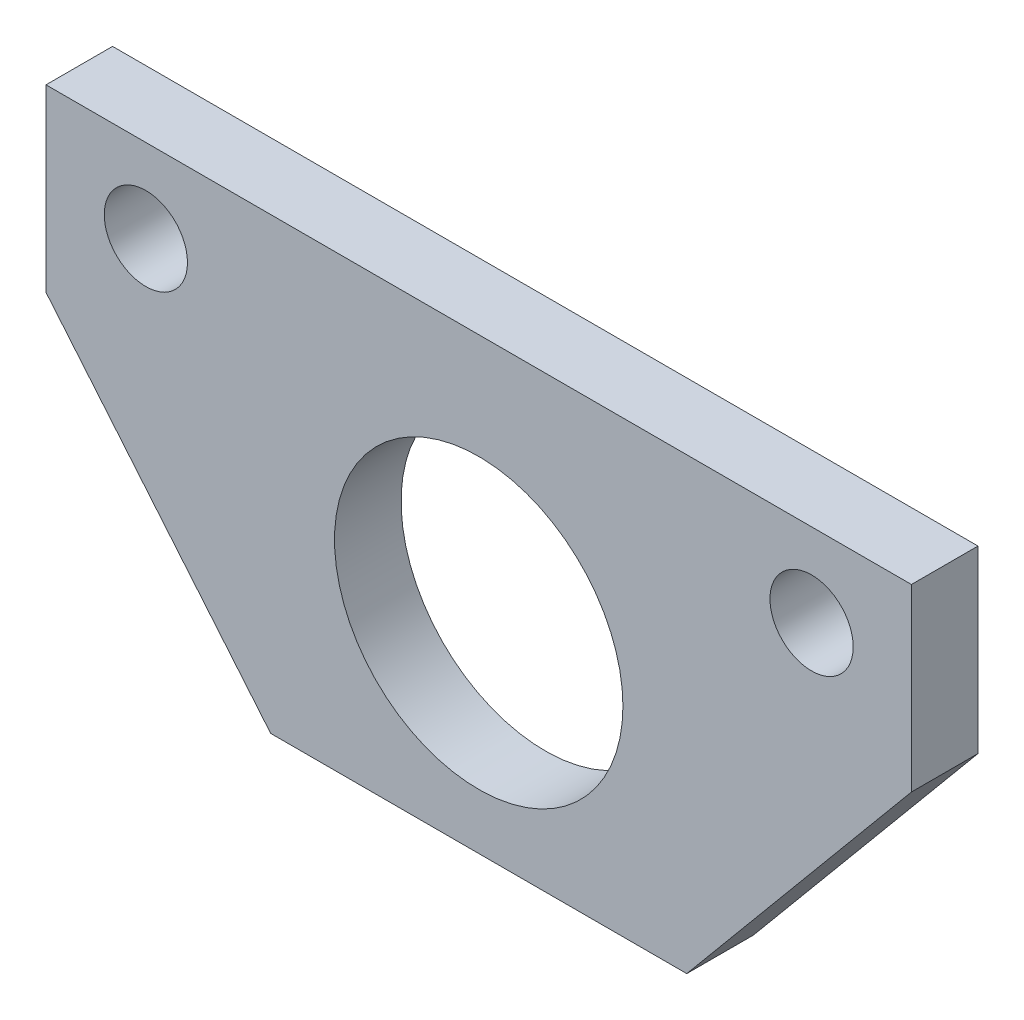
ISO-10303-21;
HEADER;
FILE_DESCRIPTION(('STEP AP214'),'2;1');
FILE_NAME('part.step','',(''),(''),'','','');
FILE_SCHEMA(('AUTOMOTIVE_DESIGN { 1 0 10303 214 1 1 1 1 }'));
ENDSEC;
DATA;
#1=APPLICATION_CONTEXT('core data for automotive mechanical design processes');
#2=APPLICATION_PROTOCOL_DEFINITION('international standard','automotive_design',2000,#1);
#3=PRODUCT_CONTEXT('',#1,'mechanical');
#4=PRODUCT('Part','Part','',(#3));
#5=PRODUCT_RELATED_PRODUCT_CATEGORY('part','',(#4));
#6=PRODUCT_DEFINITION_FORMATION('','',#4);
#7=PRODUCT_DEFINITION_CONTEXT('part definition',#1,'design');
#8=PRODUCT_DEFINITION('design','',#6,#7);
#9=PRODUCT_DEFINITION_SHAPE('','',#8);
#10=(LENGTH_UNIT() NAMED_UNIT(*) SI_UNIT(.MILLI.,.METRE.));
#11=(NAMED_UNIT(*) PLANE_ANGLE_UNIT() SI_UNIT($,.RADIAN.));
#12=(NAMED_UNIT(*) SI_UNIT($,.STERADIAN.) SOLID_ANGLE_UNIT());
#13=UNCERTAINTY_MEASURE_WITH_UNIT(LENGTH_MEASURE(1.E-05),#10,'distance_accuracy_value','');
#14=(GEOMETRIC_REPRESENTATION_CONTEXT(3) GLOBAL_UNCERTAINTY_ASSIGNED_CONTEXT((#13)) GLOBAL_UNIT_ASSIGNED_CONTEXT((#10,
#11,#12)) REPRESENTATION_CONTEXT('',''));
#15=CARTESIAN_POINT('',(0.,0.,0.));
#16=DIRECTION('',(0.,0.,1.));
#17=DIRECTION('',(1.,0.,0.));
#18=AXIS2_PLACEMENT_3D('',#15,#16,#17);
#19=CARTESIAN_POINT('',(-7.49508196721311,-6.24590163934426,5.08));
#20=DIRECTION('',(0.768221279597376,0.64018439966448,0.));
#21=DIRECTION('',(-0.64018439966448,0.768221279597376,0.));
#22=AXIS2_PLACEMENT_3D('',#19,#20,#21);
#23=PLANE('',#22);
#24=DIRECTION('',(0.64018439966448,-0.768221279597376,0.));
#25=VECTOR('',#24,1.);
#26=CARTESIAN_POINT('',(-7.49508196721311,-6.24590163934426,0.));
#27=LINE('',#26,#25);
#28=CARTESIAN_POINT('',(-33.02,24.384,0.));
#29=VERTEX_POINT('',#28);
#30=CARTESIAN_POINT('',(-15.875,3.81,0.));
#31=VERTEX_POINT('',#30);
#32=EDGE_CURVE('E112',#29,#31,#27,.T.);
#33=ORIENTED_EDGE('',*,*,#32,.T.);
#34=DIRECTION('',(0.,0.,1.));
#35=VECTOR('',#34,1.);
#36=CARTESIAN_POINT('',(-15.875,3.81,5.08));
#37=LINE('',#36,#35);
#38=CARTESIAN_POINT('',(-15.875,3.81,5.08));
#39=VERTEX_POINT('',#38);
#40=EDGE_CURVE('E49',#31,#39,#37,.T.);
#41=ORIENTED_EDGE('',*,*,#40,.T.);
#42=DIRECTION('',(0.64018439966448,-0.768221279597376,0.));
#43=VECTOR('',#42,1.);
#44=CARTESIAN_POINT('',(-7.49508196721311,-6.24590163934426,5.08));
#45=LINE('',#44,#43);
#46=CARTESIAN_POINT('',(-33.02,24.384,5.08));
#47=VERTEX_POINT('',#46);
#48=EDGE_CURVE('E102',#47,#39,#45,.T.);
#49=ORIENTED_EDGE('',*,*,#48,.F.);
#50=DIRECTION('',(0.,0.,1.));
#51=VECTOR('',#50,1.);
#52=CARTESIAN_POINT('',(-33.02,24.384,0.));
#53=LINE('',#52,#51);
#54=EDGE_CURVE('E140',#29,#47,#53,.T.);
#55=ORIENTED_EDGE('',*,*,#54,.F.);
#56=EDGE_LOOP('',(#33,#41,#49,#55));
#57=FACE_BOUND('',#56,.T.);
#58=ADVANCED_FACE('F35',(#57),#23,.F.);
#59=CARTESIAN_POINT('',(7.49508196721311,-6.24590163934426,5.08));
#60=DIRECTION('',(0.768221279597376,-0.64018439966448,0.));
#61=DIRECTION('',(0.64018439966448,0.768221279597376,0.));
#62=AXIS2_PLACEMENT_3D('',#59,#60,#61);
#63=PLANE('',#62);
#64=DIRECTION('',(0.,0.,1.));
#65=VECTOR('',#64,1.);
#66=CARTESIAN_POINT('',(15.875,3.81,5.08));
#67=LINE('',#66,#65);
#68=CARTESIAN_POINT('',(15.875,3.81,0.));
#69=VERTEX_POINT('',#68);
#70=CARTESIAN_POINT('',(15.875,3.81,5.08));
#71=VERTEX_POINT('',#70);
#72=EDGE_CURVE('E84',#69,#71,#67,.T.);
#73=ORIENTED_EDGE('',*,*,#72,.F.);
#74=DIRECTION('',(-0.64018439966448,-0.768221279597376,0.));
#75=VECTOR('',#74,1.);
#76=CARTESIAN_POINT('',(7.49508196721311,-6.24590163934426,0.));
#77=LINE('',#76,#75);
#78=CARTESIAN_POINT('',(33.02,24.384,0.));
#79=VERTEX_POINT('',#78);
#80=EDGE_CURVE('E115',#79,#69,#77,.T.);
#81=ORIENTED_EDGE('',*,*,#80,.F.);
#82=DIRECTION('',(0.,0.,1.));
#83=VECTOR('',#82,1.);
#84=CARTESIAN_POINT('',(33.02,24.384,0.));
#85=LINE('',#84,#83);
#86=CARTESIAN_POINT('',(33.02,24.384,5.08));
#87=VERTEX_POINT('',#86);
#88=EDGE_CURVE('E56',#79,#87,#85,.T.);
#89=ORIENTED_EDGE('',*,*,#88,.T.);
#90=DIRECTION('',(-0.64018439966448,-0.768221279597376,0.));
#91=VECTOR('',#90,1.);
#92=CARTESIAN_POINT('',(7.49508196721311,-6.24590163934426,5.08));
#93=LINE('',#92,#91);
#94=EDGE_CURVE('E99',#87,#71,#93,.T.);
#95=ORIENTED_EDGE('',*,*,#94,.T.);
#96=EDGE_LOOP('',(#73,#81,#89,#95));
#97=FACE_BOUND('',#96,.T.);
#98=ADVANCED_FACE('F104',(#97),#63,.T.);
#99=CARTESIAN_POINT('',(0.,38.1,5.08));
#100=DIRECTION('',(0.,1.,0.));
#101=DIRECTION('',(0.,0.,1.));
#102=AXIS2_PLACEMENT_3D('',#99,#100,#101);
#103=PLANE('',#102);
#104=DIRECTION('',(0.,0.,1.));
#105=VECTOR('',#104,1.);
#106=CARTESIAN_POINT('',(33.02,38.1,0.));
#107=LINE('',#106,#105);
#108=CARTESIAN_POINT('',(33.02,38.1,0.));
#109=VERTEX_POINT('',#108);
#110=CARTESIAN_POINT('',(33.02,38.1,5.08));
#111=VERTEX_POINT('',#110);
#112=EDGE_CURVE('E131',#109,#111,#107,.T.);
#113=ORIENTED_EDGE('',*,*,#112,.F.);
#114=DIRECTION('',(1.,0.,0.));
#115=VECTOR('',#114,1.);
#116=CARTESIAN_POINT('',(0.,38.1,0.));
#117=LINE('',#116,#115);
#118=CARTESIAN_POINT('',(-33.02,38.1,0.));
#119=VERTEX_POINT('',#118);
#120=EDGE_CURVE('E108',#119,#109,#117,.T.);
#121=ORIENTED_EDGE('',*,*,#120,.F.);
#122=DIRECTION('',(0.,0.,1.));
#123=VECTOR('',#122,1.);
#124=CARTESIAN_POINT('',(-33.02,38.1,0.));
#125=LINE('',#124,#123);
#126=CARTESIAN_POINT('',(-33.02,38.1,5.08));
#127=VERTEX_POINT('',#126);
#128=EDGE_CURVE('E129',#119,#127,#125,.T.);
#129=ORIENTED_EDGE('',*,*,#128,.T.);
#130=DIRECTION('',(1.,0.,0.));
#131=VECTOR('',#130,1.);
#132=CARTESIAN_POINT('',(0.,38.1,5.08));
#133=LINE('',#132,#131);
#134=EDGE_CURVE('E42',#127,#111,#133,.T.);
#135=ORIENTED_EDGE('',*,*,#134,.T.);
#136=EDGE_LOOP('',(#113,#121,#129,#135));
#137=FACE_BOUND('',#136,.T.);
#138=ADVANCED_FACE('F128',(#137),#103,.T.);
#139=CARTESIAN_POINT('',(0.,0.,5.08));
#140=DIRECTION('',(0.,0.,1.));
#141=DIRECTION('',(1.,0.,0.));
#142=AXIS2_PLACEMENT_3D('',#139,#140,#141);
#143=PLANE('',#142);
#144=DIRECTION('',(-1.,0.,0.));
#145=VECTOR('',#144,1.);
#146=CARTESIAN_POINT('',(-19.05,3.81,5.08));
#147=LINE('',#146,#145);
#148=EDGE_CURVE('E87',#71,#39,#147,.T.);
#149=ORIENTED_EDGE('',*,*,#148,.F.);
#150=ORIENTED_EDGE('',*,*,#94,.F.);
#151=DIRECTION('',(0.,-1.,0.));
#152=VECTOR('',#151,1.);
#153=CARTESIAN_POINT('',(33.02,38.1,5.08));
#154=LINE('',#153,#152);
#155=EDGE_CURVE('E135',#111,#87,#154,.T.);
#156=ORIENTED_EDGE('',*,*,#155,.F.);
#157=ORIENTED_EDGE('',*,*,#134,.F.);
#158=DIRECTION('',(0.,1.,0.));
#159=VECTOR('',#158,1.);
#160=CARTESIAN_POINT('',(-33.02,24.384,5.08));
#161=LINE('',#160,#159);
#162=EDGE_CURVE('E141',#47,#127,#161,.T.);
#163=ORIENTED_EDGE('',*,*,#162,.F.);
#164=ORIENTED_EDGE('',*,*,#48,.T.);
#165=EDGE_LOOP('',(#149,#150,#156,#157,#163,#164));
#166=FACE_BOUND('',#165,.T.);
#167=CARTESIAN_POINT('',(25.4,31.75,5.08));
#168=DIRECTION('',(0.,0.,1.));
#169=DIRECTION('',(1.,0.,0.));
#170=AXIS2_PLACEMENT_3D('',#167,#168,#169);
#171=CIRCLE('',#170,3.175);
#172=CARTESIAN_POINT('',(28.575,31.75,5.08));
#173=VERTEX_POINT('',#172);
#174=EDGE_CURVE('E149',#173,#173,#171,.T.);
#175=ORIENTED_EDGE('',*,*,#174,.F.);
#176=EDGE_LOOP('',(#175));
#177=FACE_BOUND('',#176,.T.);
#178=CARTESIAN_POINT('',(-25.4,31.75,5.08));
#179=DIRECTION('',(0.,0.,1.));
#180=DIRECTION('',(1.,0.,0.));
#181=AXIS2_PLACEMENT_3D('',#178,#179,#180);
#182=CIRCLE('',#181,3.175);
#183=CARTESIAN_POINT('',(-22.225,31.75,5.08));
#184=VERTEX_POINT('',#183);
#185=EDGE_CURVE('E133',#184,#184,#182,.T.);
#186=ORIENTED_EDGE('',*,*,#185,.F.);
#187=EDGE_LOOP('',(#186));
#188=FACE_BOUND('',#187,.T.);
#189=CARTESIAN_POINT('',(0.,19.05,5.08));
#190=DIRECTION('',(0.,0.,1.));
#191=DIRECTION('',(1.,0.,0.));
#192=AXIS2_PLACEMENT_3D('',#189,#190,#191);
#193=CIRCLE('',#192,11.00455);
#194=CARTESIAN_POINT('',(11.00455,19.05,5.08));
#195=VERTEX_POINT('',#194);
#196=EDGE_CURVE('E148',#195,#195,#193,.T.);
#197=ORIENTED_EDGE('',*,*,#196,.F.);
#198=EDGE_LOOP('',(#197));
#199=FACE_BOUND('',#198,.T.);
#200=ADVANCED_FACE('F96',(#166,#177,#188,#199),#143,.T.);
#201=CARTESIAN_POINT('',(0.,0.,0.));
#202=DIRECTION('',(0.,0.,1.));
#203=DIRECTION('',(1.,0.,0.));
#204=AXIS2_PLACEMENT_3D('',#201,#202,#203);
#205=PLANE('',#204);
#206=CARTESIAN_POINT('',(25.4,31.75,0.));
#207=DIRECTION('',(0.,0.,1.));
#208=DIRECTION('',(1.,0.,0.));
#209=AXIS2_PLACEMENT_3D('',#206,#207,#208);
#210=CIRCLE('',#209,3.175);
#211=CARTESIAN_POINT('',(28.575,31.75,0.));
#212=VERTEX_POINT('',#211);
#213=EDGE_CURVE('E145',#212,#212,#210,.T.);
#214=ORIENTED_EDGE('',*,*,#213,.T.);
#215=EDGE_LOOP('',(#214));
#216=FACE_BOUND('',#215,.T.);
#217=CARTESIAN_POINT('',(-25.4,31.75,0.));
#218=DIRECTION('',(0.,0.,1.));
#219=DIRECTION('',(1.,0.,0.));
#220=AXIS2_PLACEMENT_3D('',#217,#218,#219);
#221=CIRCLE('',#220,3.175);
#222=CARTESIAN_POINT('',(-22.225,31.75,0.));
#223=VERTEX_POINT('',#222);
#224=EDGE_CURVE('E152',#223,#223,#221,.T.);
#225=ORIENTED_EDGE('',*,*,#224,.T.);
#226=EDGE_LOOP('',(#225));
#227=FACE_BOUND('',#226,.T.);
#228=CARTESIAN_POINT('',(0.,19.05,0.));
#229=DIRECTION('',(0.,0.,1.));
#230=DIRECTION('',(1.,0.,0.));
#231=AXIS2_PLACEMENT_3D('',#228,#229,#230);
#232=CIRCLE('',#231,11.00455);
#233=CARTESIAN_POINT('',(11.00455,19.05,0.));
#234=VERTEX_POINT('',#233);
#235=EDGE_CURVE('E116',#234,#234,#232,.T.);
#236=ORIENTED_EDGE('',*,*,#235,.T.);
#237=EDGE_LOOP('',(#236));
#238=FACE_BOUND('',#237,.T.);
#239=ORIENTED_EDGE('',*,*,#80,.T.);
#240=DIRECTION('',(-1.,0.,0.));
#241=VECTOR('',#240,1.);
#242=CARTESIAN_POINT('',(0.,3.81,0.));
#243=LINE('',#242,#241);
#244=EDGE_CURVE('E11',#69,#31,#243,.T.);
#245=ORIENTED_EDGE('',*,*,#244,.T.);
#246=ORIENTED_EDGE('',*,*,#32,.F.);
#247=DIRECTION('',(0.,1.,0.));
#248=VECTOR('',#247,1.);
#249=CARTESIAN_POINT('',(-33.02,24.384,0.));
#250=LINE('',#249,#248);
#251=EDGE_CURVE('E124',#29,#119,#250,.T.);
#252=ORIENTED_EDGE('',*,*,#251,.T.);
#253=ORIENTED_EDGE('',*,*,#120,.T.);
#254=DIRECTION('',(0.,-1.,0.));
#255=VECTOR('',#254,1.);
#256=CARTESIAN_POINT('',(33.02,38.1,0.));
#257=LINE('',#256,#255);
#258=EDGE_CURVE('E122',#109,#79,#257,.T.);
#259=ORIENTED_EDGE('',*,*,#258,.T.);
#260=EDGE_LOOP('',(#239,#245,#246,#252,#253,#259));
#261=FACE_BOUND('',#260,.T.);
#262=ADVANCED_FACE('F121',(#216,#227,#238,#261),#205,.F.);
#263=CARTESIAN_POINT('',(0.,19.05,0.));
#264=DIRECTION('',(0.,0.,1.));
#265=DIRECTION('',(1.,0.,0.));
#266=AXIS2_PLACEMENT_3D('',#263,#264,#265);
#267=CYLINDRICAL_SURFACE('',#266,11.00455);
#268=ORIENTED_EDGE('',*,*,#235,.F.);
#269=EDGE_LOOP('',(#268));
#270=FACE_BOUND('',#269,.T.);
#271=ORIENTED_EDGE('',*,*,#196,.T.);
#272=EDGE_LOOP('',(#271));
#273=FACE_BOUND('',#272,.T.);
#274=ADVANCED_FACE('F161',(#270,#273),#267,.F.);
#275=CARTESIAN_POINT('',(-33.02,24.384,0.));
#276=DIRECTION('',(1.,0.,0.));
#277=DIRECTION('',(0.,0.,-1.));
#278=AXIS2_PLACEMENT_3D('',#275,#276,#277);
#279=PLANE('',#278);
#280=ORIENTED_EDGE('',*,*,#162,.T.);
#281=ORIENTED_EDGE('',*,*,#128,.F.);
#282=ORIENTED_EDGE('',*,*,#251,.F.);
#283=ORIENTED_EDGE('',*,*,#54,.T.);
#284=EDGE_LOOP('',(#280,#281,#282,#283));
#285=FACE_BOUND('',#284,.T.);
#286=ADVANCED_FACE('F180',(#285),#279,.F.);
#287=CARTESIAN_POINT('',(33.02,38.1,0.));
#288=DIRECTION('',(-1.,0.,0.));
#289=DIRECTION('',(0.,-1.,0.));
#290=AXIS2_PLACEMENT_3D('',#287,#288,#289);
#291=PLANE('',#290);
#292=ORIENTED_EDGE('',*,*,#155,.T.);
#293=ORIENTED_EDGE('',*,*,#88,.F.);
#294=ORIENTED_EDGE('',*,*,#258,.F.);
#295=ORIENTED_EDGE('',*,*,#112,.T.);
#296=EDGE_LOOP('',(#292,#293,#294,#295));
#297=FACE_BOUND('',#296,.T.);
#298=ADVANCED_FACE('F182',(#297),#291,.F.);
#299=CARTESIAN_POINT('',(-25.4,31.75,0.));
#300=DIRECTION('',(0.,0.,1.));
#301=DIRECTION('',(1.,0.,0.));
#302=AXIS2_PLACEMENT_3D('',#299,#300,#301);
#303=CYLINDRICAL_SURFACE('',#302,3.175);
#304=ORIENTED_EDGE('',*,*,#224,.F.);
#305=EDGE_LOOP('',(#304));
#306=FACE_BOUND('',#305,.T.);
#307=ORIENTED_EDGE('',*,*,#185,.T.);
#308=EDGE_LOOP('',(#307));
#309=FACE_BOUND('',#308,.T.);
#310=ADVANCED_FACE('F184',(#306,#309),#303,.F.);
#311=CARTESIAN_POINT('',(25.4,31.75,0.));
#312=DIRECTION('',(0.,0.,1.));
#313=DIRECTION('',(1.,0.,0.));
#314=AXIS2_PLACEMENT_3D('',#311,#312,#313);
#315=CYLINDRICAL_SURFACE('',#314,3.175);
#316=ORIENTED_EDGE('',*,*,#213,.F.);
#317=EDGE_LOOP('',(#316));
#318=FACE_BOUND('',#317,.T.);
#319=ORIENTED_EDGE('',*,*,#174,.T.);
#320=EDGE_LOOP('',(#319));
#321=FACE_BOUND('',#320,.T.);
#322=ADVANCED_FACE('F190',(#318,#321),#315,.F.);
#323=CARTESIAN_POINT('',(-19.05,3.81,0.));
#324=DIRECTION('',(0.,1.,0.));
#325=DIRECTION('',(0.,0.,1.));
#326=AXIS2_PLACEMENT_3D('',#323,#324,#325);
#327=PLANE('',#326);
#328=ORIENTED_EDGE('',*,*,#244,.F.);
#329=ORIENTED_EDGE('',*,*,#72,.T.);
#330=ORIENTED_EDGE('',*,*,#148,.T.);
#331=ORIENTED_EDGE('',*,*,#40,.F.);
#332=EDGE_LOOP('',(#328,#329,#330,#331));
#333=FACE_BOUND('',#332,.T.);
#334=ADVANCED_FACE('F86',(#333),#327,.F.);
#335=CLOSED_SHELL('',(#58,#98,#138,#200,#262,#274,#286,#298,#310,#322,#334));
#336=MANIFOLD_SOLID_BREP('B2',#335);
#337=ADVANCED_BREP_SHAPE_REPRESENTATION('',(#18,#336),#14);
#338=SHAPE_DEFINITION_REPRESENTATION(#9,#337);
ENDSEC;
END-ISO-10303-21;
